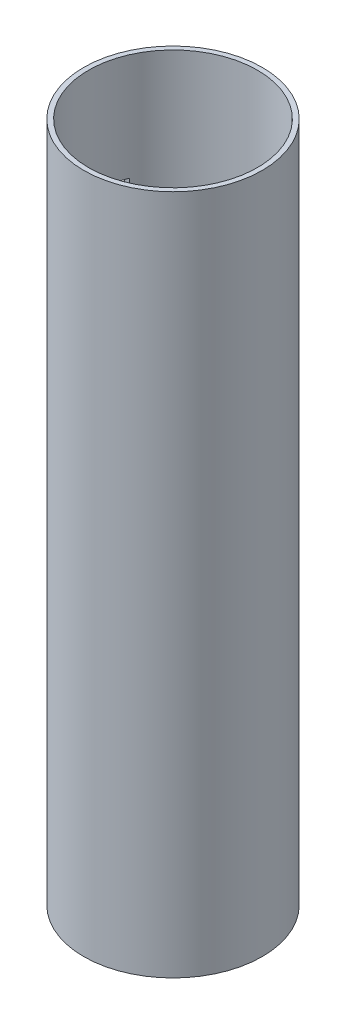
ISO-10303-21;
HEADER;
FILE_DESCRIPTION(('STEP AP214'),'2;1');
FILE_NAME('part.step','',(''),(''),'','','');
FILE_SCHEMA(('AUTOMOTIVE_DESIGN { 1 0 10303 214 1 1 1 1 }'));
ENDSEC;
DATA;
#1=APPLICATION_CONTEXT('core data for automotive mechanical design processes');
#2=APPLICATION_PROTOCOL_DEFINITION('international standard','automotive_design',2000,#1);
#3=PRODUCT_CONTEXT('',#1,'mechanical');
#4=PRODUCT('Part','Part','',(#3));
#5=PRODUCT_RELATED_PRODUCT_CATEGORY('part','',(#4));
#6=PRODUCT_DEFINITION_FORMATION('','',#4);
#7=PRODUCT_DEFINITION_CONTEXT('part definition',#1,'design');
#8=PRODUCT_DEFINITION('design','',#6,#7);
#9=PRODUCT_DEFINITION_SHAPE('','',#8);
#10=(LENGTH_UNIT() NAMED_UNIT(*) SI_UNIT(.MILLI.,.METRE.));
#11=(NAMED_UNIT(*) PLANE_ANGLE_UNIT() SI_UNIT($,.RADIAN.));
#12=(NAMED_UNIT(*) SI_UNIT($,.STERADIAN.) SOLID_ANGLE_UNIT());
#13=UNCERTAINTY_MEASURE_WITH_UNIT(LENGTH_MEASURE(1.E-05),#10,'distance_accuracy_value','');
#14=(GEOMETRIC_REPRESENTATION_CONTEXT(3) GLOBAL_UNCERTAINTY_ASSIGNED_CONTEXT((#13)) GLOBAL_UNIT_ASSIGNED_CONTEXT((#10,
#11,#12)) REPRESENTATION_CONTEXT('',''));
#15=CARTESIAN_POINT('',(0.,0.,0.));
#16=DIRECTION('',(0.,0.,1.));
#17=DIRECTION('',(1.,0.,0.));
#18=AXIS2_PLACEMENT_3D('',#15,#16,#17);
#19=CARTESIAN_POINT('',(0.,359.156,0.));
#20=DIRECTION('',(0.,-1.,0.));
#21=DIRECTION('',(0.,0.,-1.));
#22=AXIS2_PLACEMENT_3D('',#19,#20,#21);
#23=CYLINDRICAL_SURFACE('',#22,47.0842252384584);
#24=CARTESIAN_POINT('',(0.,302.694908627309,0.));
#25=DIRECTION('',(0.,1.,0.));
#26=DIRECTION('',(0.,0.,1.));
#27=AXIS2_PLACEMENT_3D('',#24,#25,#26);
#28=CIRCLE('',#27,47.0842252384584);
#29=CARTESIAN_POINT('',(-43.559785382203,302.694908627309,-17.8737059325225));
#30=VERTEX_POINT('',#29);
#31=CARTESIAN_POINT('',(-45.2047868680601,302.694908627309,13.1700991081745));
#32=VERTEX_POINT('',#31);
#33=EDGE_CURVE('E96',#30,#32,#28,.T.);
#34=ORIENTED_EDGE('',*,*,#33,.T.);
#35=DIRECTION('',(0.,-1.,0.));
#36=VECTOR('',#35,1.);
#37=CARTESIAN_POINT('',(-45.2047868680601,359.156,13.1700991081745));
#38=LINE('',#37,#36);
#39=CARTESIAN_POINT('',(-45.2047868680601,237.785134451307,13.1700991081745));
#40=VERTEX_POINT('',#39);
#41=EDGE_CURVE('E88',#32,#40,#38,.T.);
#42=ORIENTED_EDGE('',*,*,#41,.T.);
#43=CARTESIAN_POINT('',(0.,237.785134451307,0.));
#44=DIRECTION('',(0.,-1.,0.));
#45=DIRECTION('',(0.,0.,-1.));
#46=AXIS2_PLACEMENT_3D('',#43,#44,#45);
#47=CIRCLE('',#46,47.0842252384584);
#48=CARTESIAN_POINT('',(-43.559785382203,237.785134451307,-17.8737059325225));
#49=VERTEX_POINT('',#48);
#50=EDGE_CURVE('E76',#40,#49,#47,.T.);
#51=ORIENTED_EDGE('',*,*,#50,.T.);
#52=DIRECTION('',(0.,-1.,0.));
#53=VECTOR('',#52,1.);
#54=CARTESIAN_POINT('',(-43.559785382203,359.156,-17.8737059325225));
#55=LINE('',#54,#53);
#56=EDGE_CURVE('E82',#49,#30,#55,.F.);
#57=ORIENTED_EDGE('',*,*,#56,.T.);
#58=EDGE_LOOP('',(#34,#42,#51,#57));
#59=FACE_BOUND('',#58,.T.);
#60=CARTESIAN_POINT('',(0.,359.156,0.));
#61=DIRECTION('',(0.,1.,0.));
#62=DIRECTION('',(0.,0.,1.));
#63=AXIS2_PLACEMENT_3D('',#60,#61,#62);
#64=CIRCLE('',#63,47.0842252384584);
#65=CARTESIAN_POINT('',(0.,359.156,47.0842252384584));
#66=VERTEX_POINT('',#65);
#67=EDGE_CURVE('E112',#66,#66,#64,.T.);
#68=ORIENTED_EDGE('',*,*,#67,.F.);
#69=EDGE_LOOP('',(#68));
#70=FACE_BOUND('',#69,.T.);
#71=CARTESIAN_POINT('',(0.,0.,0.));
#72=DIRECTION('',(0.,1.,0.));
#73=DIRECTION('',(0.,0.,1.));
#74=AXIS2_PLACEMENT_3D('',#71,#72,#73);
#75=CIRCLE('',#74,47.0842252384584);
#76=CARTESIAN_POINT('',(0.,0.,47.0842252384584));
#77=VERTEX_POINT('',#76);
#78=EDGE_CURVE('E110',#77,#77,#75,.T.);
#79=ORIENTED_EDGE('',*,*,#78,.T.);
#80=EDGE_LOOP('',(#79));
#81=FACE_BOUND('',#80,.T.);
#82=ADVANCED_FACE('F39',(#59,#70,#81),#23,.T.);
#83=CARTESIAN_POINT('',(0.,359.156,0.));
#84=DIRECTION('',(0.,1.,0.));
#85=DIRECTION('',(0.,0.,1.));
#86=AXIS2_PLACEMENT_3D('',#83,#84,#85);
#87=PLANE('',#86);
#88=CARTESIAN_POINT('',(0.,359.156,0.));
#89=DIRECTION('',(0.,1.,0.));
#90=DIRECTION('',(0.,0.,1.));
#91=AXIS2_PLACEMENT_3D('',#88,#89,#90);
#92=CIRCLE('',#91,44.5442252384584);
#93=CARTESIAN_POINT('',(0.,359.156,44.5442252384584));
#94=VERTEX_POINT('',#93);
#95=EDGE_CURVE('E103',#94,#94,#92,.T.);
#96=ORIENTED_EDGE('',*,*,#95,.F.);
#97=EDGE_LOOP('',(#96));
#98=FACE_BOUND('',#97,.T.);
#99=ORIENTED_EDGE('',*,*,#67,.T.);
#100=EDGE_LOOP('',(#99));
#101=FACE_BOUND('',#100,.T.);
#102=ADVANCED_FACE('F153',(#98,#101),#87,.T.);
#103=CARTESIAN_POINT('',(0.,0.,0.));
#104=DIRECTION('',(0.,1.,0.));
#105=DIRECTION('',(0.,0.,1.));
#106=AXIS2_PLACEMENT_3D('',#103,#104,#105);
#107=PLANE('',#106);
#108=CARTESIAN_POINT('',(0.,0.,0.));
#109=DIRECTION('',(0.,1.,0.));
#110=DIRECTION('',(0.,0.,1.));
#111=AXIS2_PLACEMENT_3D('',#108,#109,#110);
#112=CIRCLE('',#111,44.5442252384584);
#113=CARTESIAN_POINT('',(0.,0.,44.5442252384584));
#114=VERTEX_POINT('',#113);
#115=EDGE_CURVE('E98',#114,#114,#112,.T.);
#116=ORIENTED_EDGE('',*,*,#115,.T.);
#117=EDGE_LOOP('',(#116));
#118=FACE_BOUND('',#117,.T.);
#119=ORIENTED_EDGE('',*,*,#78,.F.);
#120=EDGE_LOOP('',(#119));
#121=FACE_BOUND('',#120,.T.);
#122=ADVANCED_FACE('F157',(#118,#121),#107,.F.);
#123=CARTESIAN_POINT('',(0.,359.156,0.));
#124=DIRECTION('',(0.,-1.,0.));
#125=DIRECTION('',(0.,0.,-1.));
#126=AXIS2_PLACEMENT_3D('',#123,#124,#125);
#127=CYLINDRICAL_SURFACE('',#126,44.5442252384584);
#128=DIRECTION('',(0.,-1.,0.));
#129=VECTOR('',#128,1.);
#130=CARTESIAN_POINT('',(-42.5527495183962,359.156,13.1700991081745));
#131=LINE('',#130,#129);
#132=CARTESIAN_POINT('',(-42.5527495183962,302.694908627309,13.1700991081745));
#133=VERTEX_POINT('',#132);
#134=CARTESIAN_POINT('',(-42.5527495183962,237.785134451307,13.1700991081745));
#135=VERTEX_POINT('',#134);
#136=EDGE_CURVE('E11',#133,#135,#131,.T.);
#137=ORIENTED_EDGE('',*,*,#136,.F.);
#138=CARTESIAN_POINT('',(0.,302.694908627309,0.));
#139=DIRECTION('',(0.,1.,0.));
#140=DIRECTION('',(0.,0.,1.));
#141=AXIS2_PLACEMENT_3D('',#138,#139,#140);
#142=CIRCLE('',#141,44.5442252384584);
#143=CARTESIAN_POINT('',(-40.8009636936705,302.694908627309,-17.8737059325225));
#144=VERTEX_POINT('',#143);
#145=EDGE_CURVE('E47',#144,#133,#142,.T.);
#146=ORIENTED_EDGE('',*,*,#145,.F.);
#147=DIRECTION('',(0.,-1.,0.));
#148=VECTOR('',#147,1.);
#149=CARTESIAN_POINT('',(-40.8009636936705,359.156,-17.8737059325225));
#150=LINE('',#149,#148);
#151=CARTESIAN_POINT('',(-40.8009636936705,237.785134451307,-17.8737059325225));
#152=VERTEX_POINT('',#151);
#153=EDGE_CURVE('E122',#152,#144,#150,.F.);
#154=ORIENTED_EDGE('',*,*,#153,.F.);
#155=CARTESIAN_POINT('',(0.,237.785134451307,0.));
#156=DIRECTION('',(0.,-1.,0.));
#157=DIRECTION('',(0.,0.,-1.));
#158=AXIS2_PLACEMENT_3D('',#155,#156,#157);
#159=CIRCLE('',#158,44.5442252384584);
#160=EDGE_CURVE('E116',#135,#152,#159,.T.);
#161=ORIENTED_EDGE('',*,*,#160,.F.);
#162=EDGE_LOOP('',(#137,#146,#154,#161));
#163=FACE_BOUND('',#162,.T.);
#164=ORIENTED_EDGE('',*,*,#95,.T.);
#165=EDGE_LOOP('',(#164));
#166=FACE_BOUND('',#165,.T.);
#167=ORIENTED_EDGE('',*,*,#115,.F.);
#168=EDGE_LOOP('',(#167));
#169=FACE_BOUND('',#168,.T.);
#170=ADVANCED_FACE('F135',(#163,#166,#169),#127,.F.);
#171=CARTESIAN_POINT('',(-359.156,302.694908627309,13.1700991081745));
#172=DIRECTION('',(0.,0.,1.));
#173=DIRECTION('',(1.,0.,0.));
#174=AXIS2_PLACEMENT_3D('',#171,#172,#173);
#175=PLANE('',#174);
#176=DIRECTION('',(1.,0.,0.));
#177=VECTOR('',#176,1.);
#178=CARTESIAN_POINT('',(-359.156,302.694908627309,13.1700991081745));
#179=LINE('',#178,#177);
#180=EDGE_CURVE('E83',#32,#133,#179,.T.);
#181=ORIENTED_EDGE('',*,*,#180,.T.);
#182=ORIENTED_EDGE('',*,*,#136,.T.);
#183=DIRECTION('',(1.,0.,0.));
#184=VECTOR('',#183,1.);
#185=CARTESIAN_POINT('',(-359.156,237.785134451307,13.1700991081745));
#186=LINE('',#185,#184);
#187=EDGE_CURVE('E59',#40,#135,#186,.T.);
#188=ORIENTED_EDGE('',*,*,#187,.F.);
#189=ORIENTED_EDGE('',*,*,#41,.F.);
#190=EDGE_LOOP('',(#181,#182,#188,#189));
#191=FACE_BOUND('',#190,.T.);
#192=ADVANCED_FACE('F87',(#191),#175,.F.);
#193=CARTESIAN_POINT('',(-359.156,302.694908627309,13.1700991081745));
#194=DIRECTION('',(0.,1.,0.));
#195=DIRECTION('',(0.,0.,1.));
#196=AXIS2_PLACEMENT_3D('',#193,#194,#195);
#197=PLANE('',#196);
#198=DIRECTION('',(1.,0.,0.));
#199=VECTOR('',#198,1.);
#200=CARTESIAN_POINT('',(-359.156,302.694908627309,-17.8737059325225));
#201=LINE('',#200,#199);
#202=EDGE_CURVE('E130',#30,#144,#201,.T.);
#203=ORIENTED_EDGE('',*,*,#202,.T.);
#204=ORIENTED_EDGE('',*,*,#145,.T.);
#205=ORIENTED_EDGE('',*,*,#180,.F.);
#206=ORIENTED_EDGE('',*,*,#33,.F.);
#207=EDGE_LOOP('',(#203,#204,#205,#206));
#208=FACE_BOUND('',#207,.T.);
#209=ADVANCED_FACE('F128',(#208),#197,.F.);
#210=CARTESIAN_POINT('',(-359.156,302.694908627309,-17.8737059325225));
#211=DIRECTION('',(0.,0.,-1.));
#212=DIRECTION('',(-1.,0.,0.));
#213=AXIS2_PLACEMENT_3D('',#210,#211,#212);
#214=PLANE('',#213);
#215=DIRECTION('',(1.,0.,0.));
#216=VECTOR('',#215,1.);
#217=CARTESIAN_POINT('',(-359.156,237.785134451307,-17.8737059325225));
#218=LINE('',#217,#216);
#219=EDGE_CURVE('E54',#49,#152,#218,.T.);
#220=ORIENTED_EDGE('',*,*,#219,.T.);
#221=ORIENTED_EDGE('',*,*,#153,.T.);
#222=ORIENTED_EDGE('',*,*,#202,.F.);
#223=ORIENTED_EDGE('',*,*,#56,.F.);
#224=EDGE_LOOP('',(#220,#221,#222,#223));
#225=FACE_BOUND('',#224,.T.);
#226=ADVANCED_FACE('F138',(#225),#214,.F.);
#227=CARTESIAN_POINT('',(-359.156,237.785134451307,13.1700991081745));
#228=DIRECTION('',(0.,-1.,0.));
#229=DIRECTION('',(0.,0.,-1.));
#230=AXIS2_PLACEMENT_3D('',#227,#228,#229);
#231=PLANE('',#230);
#232=ORIENTED_EDGE('',*,*,#187,.T.);
#233=ORIENTED_EDGE('',*,*,#160,.T.);
#234=ORIENTED_EDGE('',*,*,#219,.F.);
#235=ORIENTED_EDGE('',*,*,#50,.F.);
#236=EDGE_LOOP('',(#232,#233,#234,#235));
#237=FACE_BOUND('',#236,.T.);
#238=ADVANCED_FACE('F77',(#237),#231,.F.);
#239=CLOSED_SHELL('',(#82,#102,#122,#170,#192,#209,#226,#238));
#240=MANIFOLD_SOLID_BREP('B2',#239);
#241=ADVANCED_BREP_SHAPE_REPRESENTATION('',(#18,#240),#14);
#242=SHAPE_DEFINITION_REPRESENTATION(#9,#241);
ENDSEC;
END-ISO-10303-21;
